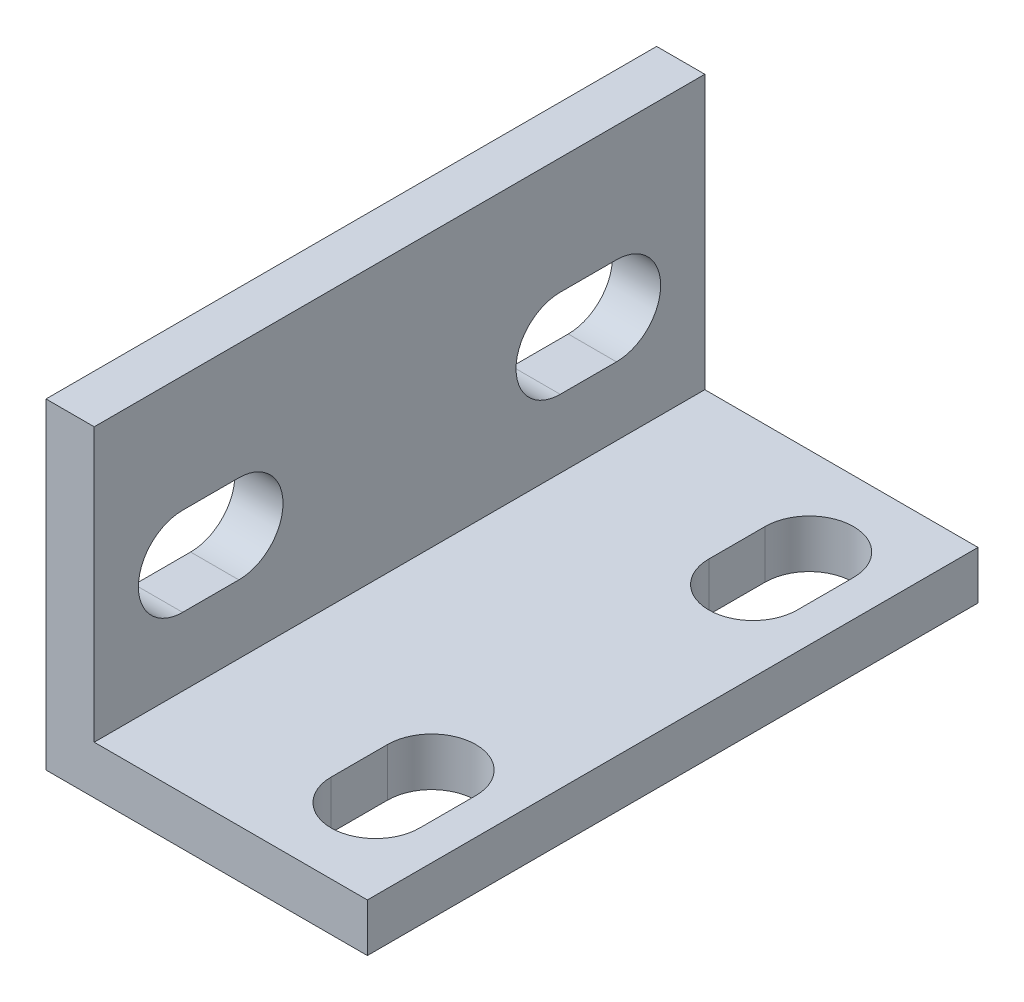
ISO-10303-21;
HEADER;
FILE_DESCRIPTION(('STEP AP214'),'2;1');
FILE_NAME('part.step','',(''),(''),'','','');
FILE_SCHEMA(('AUTOMOTIVE_DESIGN { 1 0 10303 214 1 1 1 1 }'));
ENDSEC;
DATA;
#1=APPLICATION_CONTEXT('core data for automotive mechanical design processes');
#2=APPLICATION_PROTOCOL_DEFINITION('international standard','automotive_design',2000,#1);
#3=PRODUCT_CONTEXT('',#1,'mechanical');
#4=PRODUCT('Part','Part','',(#3));
#5=PRODUCT_RELATED_PRODUCT_CATEGORY('part','',(#4));
#6=PRODUCT_DEFINITION_FORMATION('','',#4);
#7=PRODUCT_DEFINITION_CONTEXT('part definition',#1,'design');
#8=PRODUCT_DEFINITION('design','',#6,#7);
#9=PRODUCT_DEFINITION_SHAPE('','',#8);
#10=(LENGTH_UNIT() NAMED_UNIT(*) SI_UNIT(.MILLI.,.METRE.));
#11=(NAMED_UNIT(*) PLANE_ANGLE_UNIT() SI_UNIT($,.RADIAN.));
#12=(NAMED_UNIT(*) SI_UNIT($,.STERADIAN.) SOLID_ANGLE_UNIT());
#13=UNCERTAINTY_MEASURE_WITH_UNIT(LENGTH_MEASURE(1.E-05),#10,'distance_accuracy_value','');
#14=(GEOMETRIC_REPRESENTATION_CONTEXT(3) GLOBAL_UNCERTAINTY_ASSIGNED_CONTEXT((#13)) GLOBAL_UNIT_ASSIGNED_CONTEXT((#10,
#11,#12)) REPRESENTATION_CONTEXT('',''));
#15=CARTESIAN_POINT('',(0.,0.,0.));
#16=DIRECTION('',(0.,0.,1.));
#17=DIRECTION('',(1.,0.,0.));
#18=AXIS2_PLACEMENT_3D('',#15,#16,#17);
#19=CARTESIAN_POINT('',(0.,0.,38.));
#20=DIRECTION('',(0.,1.,0.));
#21=DIRECTION('',(0.,0.,1.));
#22=AXIS2_PLACEMENT_3D('',#19,#20,#21);
#23=PLANE('',#22);
#24=DIRECTION('',(0.,0.,-1.));
#25=VECTOR('',#24,1.);
#26=CARTESIAN_POINT('',(17.75,0.,5.49999999999999));
#27=LINE('',#26,#25);
#28=CARTESIAN_POINT('',(17.75,0.,9.));
#29=VERTEX_POINT('',#28);
#30=CARTESIAN_POINT('',(17.75,0.,5.49999999999999));
#31=VERTEX_POINT('',#30);
#32=EDGE_CURVE('E196',#29,#31,#27,.T.);
#33=ORIENTED_EDGE('',*,*,#32,.T.);
#34=CARTESIAN_POINT('',(15.,0.,5.49999999999999));
#35=DIRECTION('',(0.,1.,0.));
#36=DIRECTION('',(0.,0.,-1.));
#37=AXIS2_PLACEMENT_3D('',#34,#35,#36);
#38=CIRCLE('',#37,2.75000000000001);
#39=CARTESIAN_POINT('',(12.25,0.,5.49999999999999));
#40=VERTEX_POINT('',#39);
#41=EDGE_CURVE('E190',#31,#40,#38,.T.);
#42=ORIENTED_EDGE('',*,*,#41,.T.);
#43=DIRECTION('',(0.,0.,1.));
#44=VECTOR('',#43,1.);
#45=CARTESIAN_POINT('',(12.25,0.,5.49999999999999));
#46=LINE('',#45,#44);
#47=CARTESIAN_POINT('',(12.25,0.,9.));
#48=VERTEX_POINT('',#47);
#49=EDGE_CURVE('E199',#40,#48,#46,.T.);
#50=ORIENTED_EDGE('',*,*,#49,.T.);
#51=CARTESIAN_POINT('',(15.,0.,9.));
#52=DIRECTION('',(0.,1.,0.));
#53=DIRECTION('',(0.,0.,-1.));
#54=AXIS2_PLACEMENT_3D('',#51,#52,#53);
#55=CIRCLE('',#54,2.75000000000001);
#56=EDGE_CURVE('E55',#48,#29,#55,.T.);
#57=ORIENTED_EDGE('',*,*,#56,.T.);
#58=EDGE_LOOP('',(#33,#42,#50,#57));
#59=FACE_BOUND('',#58,.T.);
#60=DIRECTION('',(0.,0.,1.));
#61=VECTOR('',#60,1.);
#62=CARTESIAN_POINT('',(12.25,0.,32.5));
#63=LINE('',#62,#61);
#64=CARTESIAN_POINT('',(12.25,0.,29.));
#65=VERTEX_POINT('',#64);
#66=CARTESIAN_POINT('',(12.25,0.,32.5));
#67=VERTEX_POINT('',#66);
#68=EDGE_CURVE('E234',#65,#67,#63,.T.);
#69=ORIENTED_EDGE('',*,*,#68,.T.);
#70=CARTESIAN_POINT('',(15.,0.,32.5));
#71=DIRECTION('',(0.,1.,0.));
#72=DIRECTION('',(0.,0.,1.));
#73=AXIS2_PLACEMENT_3D('',#70,#71,#72);
#74=CIRCLE('',#73,2.75);
#75=CARTESIAN_POINT('',(17.75,0.,32.5));
#76=VERTEX_POINT('',#75);
#77=EDGE_CURVE('E224',#67,#76,#74,.T.);
#78=ORIENTED_EDGE('',*,*,#77,.T.);
#79=DIRECTION('',(0.,0.,-1.));
#80=VECTOR('',#79,1.);
#81=CARTESIAN_POINT('',(17.75,0.,32.5));
#82=LINE('',#81,#80);
#83=CARTESIAN_POINT('',(17.75,0.,29.));
#84=VERTEX_POINT('',#83);
#85=EDGE_CURVE('E227',#76,#84,#82,.T.);
#86=ORIENTED_EDGE('',*,*,#85,.T.);
#87=CARTESIAN_POINT('',(15.,0.,29.));
#88=DIRECTION('',(0.,1.,0.));
#89=DIRECTION('',(0.,0.,1.));
#90=AXIS2_PLACEMENT_3D('',#87,#88,#89);
#91=CIRCLE('',#90,2.75000000000001);
#92=EDGE_CURVE('E231',#84,#65,#91,.T.);
#93=ORIENTED_EDGE('',*,*,#92,.T.);
#94=EDGE_LOOP('',(#69,#78,#86,#93));
#95=FACE_BOUND('',#94,.T.);
#96=DIRECTION('',(1.,0.,0.));
#97=VECTOR('',#96,1.);
#98=CARTESIAN_POINT('',(0.,0.,0.));
#99=LINE('',#98,#97);
#100=CARTESIAN_POINT('',(0.,0.,0.));
#101=VERTEX_POINT('',#100);
#102=CARTESIAN_POINT('',(20.,0.,0.));
#103=VERTEX_POINT('',#102);
#104=EDGE_CURVE('E313',#101,#103,#99,.T.);
#105=ORIENTED_EDGE('',*,*,#104,.T.);
#106=DIRECTION('',(0.,0.,-1.));
#107=VECTOR('',#106,1.);
#108=CARTESIAN_POINT('',(20.,0.,38.));
#109=LINE('',#108,#107);
#110=CARTESIAN_POINT('',(20.,0.,38.));
#111=VERTEX_POINT('',#110);
#112=EDGE_CURVE('E11',#111,#103,#109,.T.);
#113=ORIENTED_EDGE('',*,*,#112,.F.);
#114=DIRECTION('',(1.,0.,0.));
#115=VECTOR('',#114,1.);
#116=CARTESIAN_POINT('',(0.,0.,38.));
#117=LINE('',#116,#115);
#118=CARTESIAN_POINT('',(0.,0.,38.));
#119=VERTEX_POINT('',#118);
#120=EDGE_CURVE('E320',#119,#111,#117,.T.);
#121=ORIENTED_EDGE('',*,*,#120,.F.);
#122=DIRECTION('',(0.,0.,-1.));
#123=VECTOR('',#122,1.);
#124=CARTESIAN_POINT('',(0.,0.,38.));
#125=LINE('',#124,#123);
#126=EDGE_CURVE('E337',#119,#101,#125,.T.);
#127=ORIENTED_EDGE('',*,*,#126,.T.);
#128=EDGE_LOOP('',(#105,#113,#121,#127));
#129=FACE_BOUND('',#128,.T.);
#130=ADVANCED_FACE('F41',(#59,#95,#129),#23,.F.);
#131=CARTESIAN_POINT('',(20.,3.,38.));
#132=DIRECTION('',(1.,0.,0.));
#133=DIRECTION('',(0.,0.,-1.));
#134=AXIS2_PLACEMENT_3D('',#131,#132,#133);
#135=PLANE('',#134);
#136=DIRECTION('',(0.,-1.,0.));
#137=VECTOR('',#136,1.);
#138=CARTESIAN_POINT('',(20.,3.,0.));
#139=LINE('',#138,#137);
#140=CARTESIAN_POINT('',(20.,3.,0.));
#141=VERTEX_POINT('',#140);
#142=EDGE_CURVE('E340',#141,#103,#139,.T.);
#143=ORIENTED_EDGE('',*,*,#142,.F.);
#144=DIRECTION('',(0.,0.,-1.));
#145=VECTOR('',#144,1.);
#146=CARTESIAN_POINT('',(20.,3.,38.));
#147=LINE('',#146,#145);
#148=CARTESIAN_POINT('',(20.,3.,38.));
#149=VERTEX_POINT('',#148);
#150=EDGE_CURVE('E48',#149,#141,#147,.T.);
#151=ORIENTED_EDGE('',*,*,#150,.F.);
#152=DIRECTION('',(0.,-1.,0.));
#153=VECTOR('',#152,1.);
#154=CARTESIAN_POINT('',(20.,3.,38.));
#155=LINE('',#154,#153);
#156=EDGE_CURVE('E322',#149,#111,#155,.T.);
#157=ORIENTED_EDGE('',*,*,#156,.T.);
#158=ORIENTED_EDGE('',*,*,#112,.T.);
#159=EDGE_LOOP('',(#143,#151,#157,#158));
#160=FACE_BOUND('',#159,.T.);
#161=ADVANCED_FACE('F367',(#160),#135,.T.);
#162=CARTESIAN_POINT('',(0.,3.,38.));
#163=DIRECTION('',(0.,1.,0.));
#164=DIRECTION('',(0.,0.,1.));
#165=AXIS2_PLACEMENT_3D('',#162,#163,#164);
#166=PLANE('',#165);
#167=CARTESIAN_POINT('',(15.,3.,5.49999999999999));
#168=DIRECTION('',(0.,1.,0.));
#169=DIRECTION('',(0.,0.,-1.));
#170=AXIS2_PLACEMENT_3D('',#167,#168,#169);
#171=CIRCLE('',#170,2.75000000000001);
#172=CARTESIAN_POINT('',(17.75,3.,5.49999999999999));
#173=VERTEX_POINT('',#172);
#174=CARTESIAN_POINT('',(12.25,3.,5.5));
#175=VERTEX_POINT('',#174);
#176=EDGE_CURVE('E63',#173,#175,#171,.T.);
#177=ORIENTED_EDGE('',*,*,#176,.F.);
#178=DIRECTION('',(0.,0.,-1.));
#179=VECTOR('',#178,1.);
#180=CARTESIAN_POINT('',(17.75,3.,5.49999999999999));
#181=LINE('',#180,#179);
#182=CARTESIAN_POINT('',(17.75,3.,9.));
#183=VERTEX_POINT('',#182);
#184=EDGE_CURVE('E205',#183,#173,#181,.T.);
#185=ORIENTED_EDGE('',*,*,#184,.F.);
#186=CARTESIAN_POINT('',(15.,3.,9.));
#187=DIRECTION('',(0.,1.,0.));
#188=DIRECTION('',(0.,0.,-1.));
#189=AXIS2_PLACEMENT_3D('',#186,#187,#188);
#190=CIRCLE('',#189,2.75000000000001);
#191=CARTESIAN_POINT('',(12.25,3.,9.));
#192=VERTEX_POINT('',#191);
#193=EDGE_CURVE('E208',#192,#183,#190,.T.);
#194=ORIENTED_EDGE('',*,*,#193,.F.);
#195=DIRECTION('',(0.,0.,1.));
#196=VECTOR('',#195,1.);
#197=CARTESIAN_POINT('',(12.25,3.,5.49999999999999));
#198=LINE('',#197,#196);
#199=EDGE_CURVE('E214',#175,#192,#198,.T.);
#200=ORIENTED_EDGE('',*,*,#199,.F.);
#201=EDGE_LOOP('',(#177,#185,#194,#200));
#202=FACE_BOUND('',#201,.T.);
#203=CARTESIAN_POINT('',(15.,3.,32.5));
#204=DIRECTION('',(0.,1.,0.));
#205=DIRECTION('',(0.,0.,1.));
#206=AXIS2_PLACEMENT_3D('',#203,#204,#205);
#207=CIRCLE('',#206,2.75);
#208=CARTESIAN_POINT('',(12.25,3.,32.5));
#209=VERTEX_POINT('',#208);
#210=CARTESIAN_POINT('',(17.75,3.,32.5));
#211=VERTEX_POINT('',#210);
#212=EDGE_CURVE('E220',#209,#211,#207,.T.);
#213=ORIENTED_EDGE('',*,*,#212,.F.);
#214=DIRECTION('',(0.,0.,1.));
#215=VECTOR('',#214,1.);
#216=CARTESIAN_POINT('',(12.25,3.,32.5));
#217=LINE('',#216,#215);
#218=CARTESIAN_POINT('',(12.25,3.,29.));
#219=VERTEX_POINT('',#218);
#220=EDGE_CURVE('E228',#219,#209,#217,.T.);
#221=ORIENTED_EDGE('',*,*,#220,.F.);
#222=CARTESIAN_POINT('',(15.,3.,29.));
#223=DIRECTION('',(0.,1.,0.));
#224=DIRECTION('',(0.,0.,1.));
#225=AXIS2_PLACEMENT_3D('',#222,#223,#224);
#226=CIRCLE('',#225,2.75000000000001);
#227=CARTESIAN_POINT('',(17.75,3.,29.));
#228=VERTEX_POINT('',#227);
#229=EDGE_CURVE('E242',#228,#219,#226,.T.);
#230=ORIENTED_EDGE('',*,*,#229,.F.);
#231=DIRECTION('',(0.,0.,-1.));
#232=VECTOR('',#231,1.);
#233=CARTESIAN_POINT('',(17.75,3.,32.5));
#234=LINE('',#233,#232);
#235=EDGE_CURVE('E239',#211,#228,#234,.T.);
#236=ORIENTED_EDGE('',*,*,#235,.F.);
#237=EDGE_LOOP('',(#213,#221,#230,#236));
#238=FACE_BOUND('',#237,.T.);
#239=DIRECTION('',(1.,0.,0.));
#240=VECTOR('',#239,1.);
#241=CARTESIAN_POINT('',(0.,3.,0.));
#242=LINE('',#241,#240);
#243=CARTESIAN_POINT('',(3.,3.,0.));
#244=VERTEX_POINT('',#243);
#245=EDGE_CURVE('E343',#244,#141,#242,.T.);
#246=ORIENTED_EDGE('',*,*,#245,.F.);
#247=DIRECTION('',(0.,0.,-1.));
#248=VECTOR('',#247,1.);
#249=CARTESIAN_POINT('',(3.,3.,38.));
#250=LINE('',#249,#248);
#251=CARTESIAN_POINT('',(3.,3.,38.));
#252=VERTEX_POINT('',#251);
#253=EDGE_CURVE('E359',#252,#244,#250,.T.);
#254=ORIENTED_EDGE('',*,*,#253,.F.);
#255=DIRECTION('',(1.,0.,0.));
#256=VECTOR('',#255,1.);
#257=CARTESIAN_POINT('',(0.,3.,38.));
#258=LINE('',#257,#256);
#259=EDGE_CURVE('E326',#252,#149,#258,.T.);
#260=ORIENTED_EDGE('',*,*,#259,.T.);
#261=ORIENTED_EDGE('',*,*,#150,.T.);
#262=EDGE_LOOP('',(#246,#254,#260,#261));
#263=FACE_BOUND('',#262,.T.);
#264=ADVANCED_FACE('F363',(#202,#238,#263),#166,.T.);
#265=CARTESIAN_POINT('',(3.,20.,38.));
#266=DIRECTION('',(1.,0.,0.));
#267=DIRECTION('',(0.,0.,-1.));
#268=AXIS2_PLACEMENT_3D('',#265,#266,#267);
#269=PLANE('',#268);
#270=CARTESIAN_POINT('',(3.,10.,9.00000000000001));
#271=DIRECTION('',(1.,0.,0.));
#272=DIRECTION('',(0.,0.,1.));
#273=AXIS2_PLACEMENT_3D('',#270,#271,#272);
#274=CIRCLE('',#273,2.75);
#275=CARTESIAN_POINT('',(3.,12.75,9.00000000000001));
#276=VERTEX_POINT('',#275);
#277=CARTESIAN_POINT('',(3.,7.25,9.));
#278=VERTEX_POINT('',#277);
#279=EDGE_CURVE('E249',#276,#278,#274,.T.);
#280=ORIENTED_EDGE('',*,*,#279,.F.);
#281=DIRECTION('',(0.,0.,1.));
#282=VECTOR('',#281,1.);
#283=CARTESIAN_POINT('',(3.,12.75,9.00000000000001));
#284=LINE('',#283,#282);
#285=CARTESIAN_POINT('',(3.,12.75,5.5));
#286=VERTEX_POINT('',#285);
#287=EDGE_CURVE('E260',#286,#276,#284,.T.);
#288=ORIENTED_EDGE('',*,*,#287,.F.);
#289=CARTESIAN_POINT('',(3.,10.,5.5));
#290=DIRECTION('',(1.,0.,0.));
#291=DIRECTION('',(0.,0.,1.));
#292=AXIS2_PLACEMENT_3D('',#289,#290,#291);
#293=CIRCLE('',#292,2.75);
#294=CARTESIAN_POINT('',(3.,7.25,5.5));
#295=VERTEX_POINT('',#294);
#296=EDGE_CURVE('E274',#295,#286,#293,.T.);
#297=ORIENTED_EDGE('',*,*,#296,.F.);
#298=DIRECTION('',(0.,0.,-1.));
#299=VECTOR('',#298,1.);
#300=CARTESIAN_POINT('',(3.,7.25,9.00000000000001));
#301=LINE('',#300,#299);
#302=EDGE_CURVE('E271',#278,#295,#301,.T.);
#303=ORIENTED_EDGE('',*,*,#302,.F.);
#304=EDGE_LOOP('',(#280,#288,#297,#303));
#305=FACE_BOUND('',#304,.T.);
#306=CARTESIAN_POINT('',(3.,10.,29.));
#307=DIRECTION('',(1.,0.,0.));
#308=DIRECTION('',(0.,0.,-1.));
#309=AXIS2_PLACEMENT_3D('',#306,#307,#308);
#310=CIRCLE('',#309,2.75);
#311=CARTESIAN_POINT('',(3.,7.25,29.));
#312=VERTEX_POINT('',#311);
#313=CARTESIAN_POINT('',(3.,12.75,29.));
#314=VERTEX_POINT('',#313);
#315=EDGE_CURVE('E281',#312,#314,#310,.T.);
#316=ORIENTED_EDGE('',*,*,#315,.F.);
#317=DIRECTION('',(0.,0.,-1.));
#318=VECTOR('',#317,1.);
#319=CARTESIAN_POINT('',(3.,7.25,29.));
#320=LINE('',#319,#318);
#321=CARTESIAN_POINT('',(3.,7.25,32.5));
#322=VERTEX_POINT('',#321);
#323=EDGE_CURVE('E292',#322,#312,#320,.T.);
#324=ORIENTED_EDGE('',*,*,#323,.F.);
#325=CARTESIAN_POINT('',(3.,10.,32.5));
#326=DIRECTION('',(1.,0.,0.));
#327=DIRECTION('',(0.,0.,-1.));
#328=AXIS2_PLACEMENT_3D('',#325,#326,#327);
#329=CIRCLE('',#328,2.75);
#330=CARTESIAN_POINT('',(3.,12.75,32.5));
#331=VERTEX_POINT('',#330);
#332=EDGE_CURVE('E306',#331,#322,#329,.T.);
#333=ORIENTED_EDGE('',*,*,#332,.F.);
#334=DIRECTION('',(0.,0.,1.));
#335=VECTOR('',#334,1.);
#336=CARTESIAN_POINT('',(3.,12.75,29.));
#337=LINE('',#336,#335);
#338=EDGE_CURVE('E303',#314,#331,#337,.T.);
#339=ORIENTED_EDGE('',*,*,#338,.F.);
#340=EDGE_LOOP('',(#316,#324,#333,#339));
#341=FACE_BOUND('',#340,.T.);
#342=DIRECTION('',(0.,1.,0.));
#343=VECTOR('',#342,1.);
#344=CARTESIAN_POINT('',(3.,20.,0.));
#345=LINE('',#344,#343);
#346=CARTESIAN_POINT('',(3.,20.,0.));
#347=VERTEX_POINT('',#346);
#348=EDGE_CURVE('E346',#347,#244,#345,.F.);
#349=ORIENTED_EDGE('',*,*,#348,.F.);
#350=DIRECTION('',(0.,0.,-1.));
#351=VECTOR('',#350,1.);
#352=CARTESIAN_POINT('',(3.,20.,38.));
#353=LINE('',#352,#351);
#354=CARTESIAN_POINT('',(3.,20.,38.));
#355=VERTEX_POINT('',#354);
#356=EDGE_CURVE('E357',#355,#347,#353,.T.);
#357=ORIENTED_EDGE('',*,*,#356,.F.);
#358=DIRECTION('',(0.,1.,0.));
#359=VECTOR('',#358,1.);
#360=CARTESIAN_POINT('',(3.,20.,38.));
#361=LINE('',#360,#359);
#362=EDGE_CURVE('E329',#355,#252,#361,.F.);
#363=ORIENTED_EDGE('',*,*,#362,.T.);
#364=ORIENTED_EDGE('',*,*,#253,.T.);
#365=EDGE_LOOP('',(#349,#357,#363,#364));
#366=FACE_BOUND('',#365,.T.);
#367=ADVANCED_FACE('F376',(#305,#341,#366),#269,.T.);
#368=CARTESIAN_POINT('',(0.,20.,38.));
#369=DIRECTION('',(0.,1.,0.));
#370=DIRECTION('',(0.,0.,1.));
#371=AXIS2_PLACEMENT_3D('',#368,#369,#370);
#372=PLANE('',#371);
#373=DIRECTION('',(1.,0.,0.));
#374=VECTOR('',#373,1.);
#375=CARTESIAN_POINT('',(0.,20.,0.));
#376=LINE('',#375,#374);
#377=CARTESIAN_POINT('',(0.,20.,0.));
#378=VERTEX_POINT('',#377);
#379=EDGE_CURVE('E349',#378,#347,#376,.T.);
#380=ORIENTED_EDGE('',*,*,#379,.F.);
#381=DIRECTION('',(0.,0.,-1.));
#382=VECTOR('',#381,1.);
#383=CARTESIAN_POINT('',(0.,20.,38.));
#384=LINE('',#383,#382);
#385=CARTESIAN_POINT('',(0.,20.,38.));
#386=VERTEX_POINT('',#385);
#387=EDGE_CURVE('E355',#386,#378,#384,.T.);
#388=ORIENTED_EDGE('',*,*,#387,.F.);
#389=DIRECTION('',(1.,0.,0.));
#390=VECTOR('',#389,1.);
#391=CARTESIAN_POINT('',(0.,20.,38.));
#392=LINE('',#391,#390);
#393=EDGE_CURVE('E332',#386,#355,#392,.T.);
#394=ORIENTED_EDGE('',*,*,#393,.T.);
#395=ORIENTED_EDGE('',*,*,#356,.T.);
#396=EDGE_LOOP('',(#380,#388,#394,#395));
#397=FACE_BOUND('',#396,.T.);
#398=ADVANCED_FACE('F387',(#397),#372,.T.);
#399=CARTESIAN_POINT('',(0.,20.,38.));
#400=DIRECTION('',(1.,0.,0.));
#401=DIRECTION('',(0.,0.,-1.));
#402=AXIS2_PLACEMENT_3D('',#399,#400,#401);
#403=PLANE('',#402);
#404=DIRECTION('',(0.,0.,1.));
#405=VECTOR('',#404,1.);
#406=CARTESIAN_POINT('',(0.,12.75,9.00000000000001));
#407=LINE('',#406,#405);
#408=CARTESIAN_POINT('',(0.,12.75,5.5));
#409=VERTEX_POINT('',#408);
#410=CARTESIAN_POINT('',(0.,12.75,9.00000000000001));
#411=VERTEX_POINT('',#410);
#412=EDGE_CURVE('E266',#409,#411,#407,.T.);
#413=ORIENTED_EDGE('',*,*,#412,.T.);
#414=CARTESIAN_POINT('',(0.,10.,9.00000000000001));
#415=DIRECTION('',(1.,0.,0.));
#416=DIRECTION('',(0.,0.,1.));
#417=AXIS2_PLACEMENT_3D('',#414,#415,#416);
#418=CIRCLE('',#417,2.75);
#419=CARTESIAN_POINT('',(0.,7.25,9.00000000000001));
#420=VERTEX_POINT('',#419);
#421=EDGE_CURVE('E256',#411,#420,#418,.T.);
#422=ORIENTED_EDGE('',*,*,#421,.T.);
#423=DIRECTION('',(0.,0.,-1.));
#424=VECTOR('',#423,1.);
#425=CARTESIAN_POINT('',(0.,7.25,9.00000000000001));
#426=LINE('',#425,#424);
#427=CARTESIAN_POINT('',(0.,7.25,5.50000000000001));
#428=VERTEX_POINT('',#427);
#429=EDGE_CURVE('E259',#420,#428,#426,.T.);
#430=ORIENTED_EDGE('',*,*,#429,.T.);
#431=CARTESIAN_POINT('',(0.,10.,5.5));
#432=DIRECTION('',(1.,0.,0.));
#433=DIRECTION('',(0.,0.,1.));
#434=AXIS2_PLACEMENT_3D('',#431,#432,#433);
#435=CIRCLE('',#434,2.75);
#436=EDGE_CURVE('E263',#428,#409,#435,.T.);
#437=ORIENTED_EDGE('',*,*,#436,.T.);
#438=EDGE_LOOP('',(#413,#422,#430,#437));
#439=FACE_BOUND('',#438,.T.);
#440=DIRECTION('',(0.,0.,-1.));
#441=VECTOR('',#440,1.);
#442=CARTESIAN_POINT('',(0.,7.25,29.));
#443=LINE('',#442,#441);
#444=CARTESIAN_POINT('',(0.,7.25,32.5));
#445=VERTEX_POINT('',#444);
#446=CARTESIAN_POINT('',(0.,7.25,29.));
#447=VERTEX_POINT('',#446);
#448=EDGE_CURVE('E298',#445,#447,#443,.T.);
#449=ORIENTED_EDGE('',*,*,#448,.T.);
#450=CARTESIAN_POINT('',(0.,10.,29.));
#451=DIRECTION('',(1.,0.,0.));
#452=DIRECTION('',(0.,0.,-1.));
#453=AXIS2_PLACEMENT_3D('',#450,#451,#452);
#454=CIRCLE('',#453,2.75);
#455=CARTESIAN_POINT('',(0.,12.75,29.));
#456=VERTEX_POINT('',#455);
#457=EDGE_CURVE('E288',#447,#456,#454,.T.);
#458=ORIENTED_EDGE('',*,*,#457,.T.);
#459=DIRECTION('',(0.,0.,1.));
#460=VECTOR('',#459,1.);
#461=CARTESIAN_POINT('',(0.,12.75,29.));
#462=LINE('',#461,#460);
#463=CARTESIAN_POINT('',(0.,12.75,32.5));
#464=VERTEX_POINT('',#463);
#465=EDGE_CURVE('E291',#456,#464,#462,.T.);
#466=ORIENTED_EDGE('',*,*,#465,.T.);
#467=CARTESIAN_POINT('',(0.,10.,32.5));
#468=DIRECTION('',(1.,0.,0.));
#469=DIRECTION('',(0.,0.,-1.));
#470=AXIS2_PLACEMENT_3D('',#467,#468,#469);
#471=CIRCLE('',#470,2.75);
#472=EDGE_CURVE('E295',#464,#445,#471,.T.);
#473=ORIENTED_EDGE('',*,*,#472,.T.);
#474=EDGE_LOOP('',(#449,#458,#466,#473));
#475=FACE_BOUND('',#474,.T.);
#476=DIRECTION('',(0.,-1.,0.));
#477=VECTOR('',#476,1.);
#478=CARTESIAN_POINT('',(0.,20.,0.));
#479=LINE('',#478,#477);
#480=EDGE_CURVE('E323',#378,#101,#479,.T.);
#481=ORIENTED_EDGE('',*,*,#480,.T.);
#482=ORIENTED_EDGE('',*,*,#126,.F.);
#483=DIRECTION('',(0.,-1.,0.));
#484=VECTOR('',#483,1.);
#485=CARTESIAN_POINT('',(0.,20.,38.));
#486=LINE('',#485,#484);
#487=EDGE_CURVE('E335',#386,#119,#486,.T.);
#488=ORIENTED_EDGE('',*,*,#487,.F.);
#489=ORIENTED_EDGE('',*,*,#387,.T.);
#490=EDGE_LOOP('',(#481,#482,#488,#489));
#491=FACE_BOUND('',#490,.T.);
#492=ADVANCED_FACE('F388',(#439,#475,#491),#403,.F.);
#493=CARTESIAN_POINT('',(0.,0.,38.));
#494=DIRECTION('',(0.,0.,-1.));
#495=DIRECTION('',(-1.,0.,0.));
#496=AXIS2_PLACEMENT_3D('',#493,#494,#495);
#497=PLANE('',#496);
#498=ORIENTED_EDGE('',*,*,#120,.T.);
#499=ORIENTED_EDGE('',*,*,#156,.F.);
#500=ORIENTED_EDGE('',*,*,#259,.F.);
#501=ORIENTED_EDGE('',*,*,#362,.F.);
#502=ORIENTED_EDGE('',*,*,#393,.F.);
#503=ORIENTED_EDGE('',*,*,#487,.T.);
#504=EDGE_LOOP('',(#498,#499,#500,#501,#502,#503));
#505=FACE_BOUND('',#504,.T.);
#506=ADVANCED_FACE('F379',(#505),#497,.F.);
#507=CARTESIAN_POINT('',(0.,0.,0.));
#508=DIRECTION('',(0.,0.,-1.));
#509=DIRECTION('',(-1.,0.,0.));
#510=AXIS2_PLACEMENT_3D('',#507,#508,#509);
#511=PLANE('',#510);
#512=ORIENTED_EDGE('',*,*,#104,.F.);
#513=ORIENTED_EDGE('',*,*,#480,.F.);
#514=ORIENTED_EDGE('',*,*,#379,.T.);
#515=ORIENTED_EDGE('',*,*,#348,.T.);
#516=ORIENTED_EDGE('',*,*,#245,.T.);
#517=ORIENTED_EDGE('',*,*,#142,.T.);
#518=EDGE_LOOP('',(#512,#513,#514,#515,#516,#517));
#519=FACE_BOUND('',#518,.T.);
#520=ADVANCED_FACE('F371',(#519),#511,.T.);
#521=CARTESIAN_POINT('',(0.,10.,29.));
#522=DIRECTION('',(1.,0.,0.));
#523=DIRECTION('',(0.,0.,-1.));
#524=AXIS2_PLACEMENT_3D('',#521,#522,#523);
#525=CYLINDRICAL_SURFACE('',#524,2.75);
#526=ORIENTED_EDGE('',*,*,#315,.T.);
#527=DIRECTION('',(1.,0.,0.));
#528=VECTOR('',#527,1.);
#529=CARTESIAN_POINT('',(0.,12.75,29.));
#530=LINE('',#529,#528);
#531=EDGE_CURVE('E301',#456,#314,#530,.T.);
#532=ORIENTED_EDGE('',*,*,#531,.F.);
#533=ORIENTED_EDGE('',*,*,#457,.F.);
#534=DIRECTION('',(1.,0.,0.));
#535=VECTOR('',#534,1.);
#536=CARTESIAN_POINT('',(0.,7.25,29.));
#537=LINE('',#536,#535);
#538=EDGE_CURVE('E311',#447,#312,#537,.T.);
#539=ORIENTED_EDGE('',*,*,#538,.T.);
#540=EDGE_LOOP('',(#526,#532,#533,#539));
#541=FACE_BOUND('',#540,.T.);
#542=ADVANCED_FACE('F426',(#541),#525,.F.);
#543=CARTESIAN_POINT('',(0.,7.25,29.));
#544=DIRECTION('',(0.,-1.,0.));
#545=DIRECTION('',(0.,0.,-1.));
#546=AXIS2_PLACEMENT_3D('',#543,#544,#545);
#547=PLANE('',#546);
#548=ORIENTED_EDGE('',*,*,#323,.T.);
#549=ORIENTED_EDGE('',*,*,#538,.F.);
#550=ORIENTED_EDGE('',*,*,#448,.F.);
#551=DIRECTION('',(1.,0.,0.));
#552=VECTOR('',#551,1.);
#553=CARTESIAN_POINT('',(0.,7.25,32.5));
#554=LINE('',#553,#552);
#555=EDGE_CURVE('E314',#445,#322,#554,.T.);
#556=ORIENTED_EDGE('',*,*,#555,.T.);
#557=EDGE_LOOP('',(#548,#549,#550,#556));
#558=FACE_BOUND('',#557,.T.);
#559=ADVANCED_FACE('F434',(#558),#547,.F.);
#560=CARTESIAN_POINT('',(0.,10.,32.5));
#561=DIRECTION('',(1.,0.,0.));
#562=DIRECTION('',(0.,0.,-1.));
#563=AXIS2_PLACEMENT_3D('',#560,#561,#562);
#564=CYLINDRICAL_SURFACE('',#563,2.75);
#565=ORIENTED_EDGE('',*,*,#332,.T.);
#566=ORIENTED_EDGE('',*,*,#555,.F.);
#567=ORIENTED_EDGE('',*,*,#472,.F.);
#568=DIRECTION('',(1.,0.,0.));
#569=VECTOR('',#568,1.);
#570=CARTESIAN_POINT('',(0.,12.75,32.5));
#571=LINE('',#570,#569);
#572=EDGE_CURVE('E316',#464,#331,#571,.T.);
#573=ORIENTED_EDGE('',*,*,#572,.T.);
#574=EDGE_LOOP('',(#565,#566,#567,#573));
#575=FACE_BOUND('',#574,.T.);
#576=ADVANCED_FACE('F436',(#575),#564,.F.);
#577=CARTESIAN_POINT('',(0.,12.75,29.));
#578=DIRECTION('',(0.,1.,0.));
#579=DIRECTION('',(0.,0.,1.));
#580=AXIS2_PLACEMENT_3D('',#577,#578,#579);
#581=PLANE('',#580);
#582=ORIENTED_EDGE('',*,*,#338,.T.);
#583=ORIENTED_EDGE('',*,*,#572,.F.);
#584=ORIENTED_EDGE('',*,*,#465,.F.);
#585=ORIENTED_EDGE('',*,*,#531,.T.);
#586=EDGE_LOOP('',(#582,#583,#584,#585));
#587=FACE_BOUND('',#586,.T.);
#588=ADVANCED_FACE('F430',(#587),#581,.F.);
#589=CARTESIAN_POINT('',(0.,10.,9.00000000000001));
#590=DIRECTION('',(1.,0.,0.));
#591=DIRECTION('',(0.,0.,-1.));
#592=AXIS2_PLACEMENT_3D('',#589,#590,#591);
#593=CYLINDRICAL_SURFACE('',#592,2.75);
#594=ORIENTED_EDGE('',*,*,#279,.T.);
#595=DIRECTION('',(1.,0.,0.));
#596=VECTOR('',#595,1.);
#597=CARTESIAN_POINT('',(0.,7.25,9.00000000000001));
#598=LINE('',#597,#596);
#599=EDGE_CURVE('E269',#420,#278,#598,.T.);
#600=ORIENTED_EDGE('',*,*,#599,.F.);
#601=ORIENTED_EDGE('',*,*,#421,.F.);
#602=DIRECTION('',(1.,0.,0.));
#603=VECTOR('',#602,1.);
#604=CARTESIAN_POINT('',(0.,12.75,9.00000000000001));
#605=LINE('',#604,#603);
#606=EDGE_CURVE('E279',#411,#276,#605,.T.);
#607=ORIENTED_EDGE('',*,*,#606,.T.);
#608=EDGE_LOOP('',(#594,#600,#601,#607));
#609=FACE_BOUND('',#608,.T.);
#610=ADVANCED_FACE('F443',(#609),#593,.F.);
#611=CARTESIAN_POINT('',(0.,12.75,9.00000000000001));
#612=DIRECTION('',(0.,1.,0.));
#613=DIRECTION('',(0.,0.,1.));
#614=AXIS2_PLACEMENT_3D('',#611,#612,#613);
#615=PLANE('',#614);
#616=ORIENTED_EDGE('',*,*,#287,.T.);
#617=ORIENTED_EDGE('',*,*,#606,.F.);
#618=ORIENTED_EDGE('',*,*,#412,.F.);
#619=DIRECTION('',(1.,0.,0.));
#620=VECTOR('',#619,1.);
#621=CARTESIAN_POINT('',(0.,12.75,5.5));
#622=LINE('',#621,#620);
#623=EDGE_CURVE('E282',#409,#286,#622,.T.);
#624=ORIENTED_EDGE('',*,*,#623,.T.);
#625=EDGE_LOOP('',(#616,#617,#618,#624));
#626=FACE_BOUND('',#625,.T.);
#627=ADVANCED_FACE('F535',(#626),#615,.F.);
#628=CARTESIAN_POINT('',(0.,10.,5.5));
#629=DIRECTION('',(1.,0.,0.));
#630=DIRECTION('',(0.,0.,-1.));
#631=AXIS2_PLACEMENT_3D('',#628,#629,#630);
#632=CYLINDRICAL_SURFACE('',#631,2.75);
#633=ORIENTED_EDGE('',*,*,#296,.T.);
#634=ORIENTED_EDGE('',*,*,#623,.F.);
#635=ORIENTED_EDGE('',*,*,#436,.F.);
#636=DIRECTION('',(1.,0.,0.));
#637=VECTOR('',#636,1.);
#638=CARTESIAN_POINT('',(0.,7.25,5.5));
#639=LINE('',#638,#637);
#640=EDGE_CURVE('E284',#428,#295,#639,.T.);
#641=ORIENTED_EDGE('',*,*,#640,.T.);
#642=EDGE_LOOP('',(#633,#634,#635,#641));
#643=FACE_BOUND('',#642,.T.);
#644=ADVANCED_FACE('F538',(#643),#632,.F.);
#645=CARTESIAN_POINT('',(0.,7.25,9.00000000000001));
#646=DIRECTION('',(0.,-1.,0.));
#647=DIRECTION('',(0.,0.,-1.));
#648=AXIS2_PLACEMENT_3D('',#645,#646,#647);
#649=PLANE('',#648);
#650=ORIENTED_EDGE('',*,*,#302,.T.);
#651=ORIENTED_EDGE('',*,*,#640,.F.);
#652=ORIENTED_EDGE('',*,*,#429,.F.);
#653=ORIENTED_EDGE('',*,*,#599,.T.);
#654=EDGE_LOOP('',(#650,#651,#652,#653));
#655=FACE_BOUND('',#654,.T.);
#656=ADVANCED_FACE('F479',(#655),#649,.F.);
#657=CARTESIAN_POINT('',(15.,0.,32.5));
#658=DIRECTION('',(0.,1.,0.));
#659=DIRECTION('',(0.,0.,1.));
#660=AXIS2_PLACEMENT_3D('',#657,#658,#659);
#661=CYLINDRICAL_SURFACE('',#660,2.75);
#662=ORIENTED_EDGE('',*,*,#212,.T.);
#663=DIRECTION('',(0.,1.,0.));
#664=VECTOR('',#663,1.);
#665=CARTESIAN_POINT('',(17.75,0.,32.5));
#666=LINE('',#665,#664);
#667=EDGE_CURVE('E237',#76,#211,#666,.T.);
#668=ORIENTED_EDGE('',*,*,#667,.F.);
#669=ORIENTED_EDGE('',*,*,#77,.F.);
#670=DIRECTION('',(0.,1.,0.));
#671=VECTOR('',#670,1.);
#672=CARTESIAN_POINT('',(12.25,0.,32.5));
#673=LINE('',#672,#671);
#674=EDGE_CURVE('E247',#67,#209,#673,.T.);
#675=ORIENTED_EDGE('',*,*,#674,.T.);
#676=EDGE_LOOP('',(#662,#668,#669,#675));
#677=FACE_BOUND('',#676,.T.);
#678=ADVANCED_FACE('F474',(#677),#661,.F.);
#679=CARTESIAN_POINT('',(12.25,0.,32.5));
#680=DIRECTION('',(-1.,0.,0.));
#681=DIRECTION('',(0.,0.,1.));
#682=AXIS2_PLACEMENT_3D('',#679,#680,#681);
#683=PLANE('',#682);
#684=ORIENTED_EDGE('',*,*,#220,.T.);
#685=ORIENTED_EDGE('',*,*,#674,.F.);
#686=ORIENTED_EDGE('',*,*,#68,.F.);
#687=DIRECTION('',(0.,1.,0.));
#688=VECTOR('',#687,1.);
#689=CARTESIAN_POINT('',(12.25,0.,29.));
#690=LINE('',#689,#688);
#691=EDGE_CURVE('E250',#65,#219,#690,.T.);
#692=ORIENTED_EDGE('',*,*,#691,.T.);
#693=EDGE_LOOP('',(#684,#685,#686,#692));
#694=FACE_BOUND('',#693,.T.);
#695=ADVANCED_FACE('F478',(#694),#683,.F.);
#696=CARTESIAN_POINT('',(15.,0.,29.));
#697=DIRECTION('',(0.,1.,0.));
#698=DIRECTION('',(0.,0.,1.));
#699=AXIS2_PLACEMENT_3D('',#696,#697,#698);
#700=CYLINDRICAL_SURFACE('',#699,2.75000000000001);
#701=ORIENTED_EDGE('',*,*,#229,.T.);
#702=ORIENTED_EDGE('',*,*,#691,.F.);
#703=ORIENTED_EDGE('',*,*,#92,.F.);
#704=DIRECTION('',(0.,1.,0.));
#705=VECTOR('',#704,1.);
#706=CARTESIAN_POINT('',(17.75,0.,29.));
#707=LINE('',#706,#705);
#708=EDGE_CURVE('E252',#84,#228,#707,.T.);
#709=ORIENTED_EDGE('',*,*,#708,.T.);
#710=EDGE_LOOP('',(#701,#702,#703,#709));
#711=FACE_BOUND('',#710,.T.);
#712=ADVANCED_FACE('F488',(#711),#700,.F.);
#713=CARTESIAN_POINT('',(17.75,0.,32.5));
#714=DIRECTION('',(1.,0.,0.));
#715=DIRECTION('',(0.,0.,-1.));
#716=AXIS2_PLACEMENT_3D('',#713,#714,#715);
#717=PLANE('',#716);
#718=ORIENTED_EDGE('',*,*,#235,.T.);
#719=ORIENTED_EDGE('',*,*,#708,.F.);
#720=ORIENTED_EDGE('',*,*,#85,.F.);
#721=ORIENTED_EDGE('',*,*,#667,.T.);
#722=EDGE_LOOP('',(#718,#719,#720,#721));
#723=FACE_BOUND('',#722,.T.);
#724=ADVANCED_FACE('F496',(#723),#717,.F.);
#725=CARTESIAN_POINT('',(15.,0.,5.49999999999999));
#726=DIRECTION('',(0.,1.,0.));
#727=DIRECTION('',(0.,0.,1.));
#728=AXIS2_PLACEMENT_3D('',#725,#726,#727);
#729=CYLINDRICAL_SURFACE('',#728,2.75000000000001);
#730=ORIENTED_EDGE('',*,*,#176,.T.);
#731=DIRECTION('',(0.,1.,0.));
#732=VECTOR('',#731,1.);
#733=CARTESIAN_POINT('',(12.25,0.,5.49999999999999));
#734=LINE('',#733,#732);
#735=EDGE_CURVE('E186',#40,#175,#734,.T.);
#736=ORIENTED_EDGE('',*,*,#735,.F.);
#737=ORIENTED_EDGE('',*,*,#41,.F.);
#738=DIRECTION('',(0.,1.,0.));
#739=VECTOR('',#738,1.);
#740=CARTESIAN_POINT('',(17.75,0.,5.49999999999999));
#741=LINE('',#740,#739);
#742=EDGE_CURVE('E218',#31,#173,#741,.T.);
#743=ORIENTED_EDGE('',*,*,#742,.T.);
#744=EDGE_LOOP('',(#730,#736,#737,#743));
#745=FACE_BOUND('',#744,.T.);
#746=ADVANCED_FACE('F188',(#745),#729,.F.);
#747=CARTESIAN_POINT('',(17.75,0.,5.49999999999999));
#748=DIRECTION('',(1.,0.,0.));
#749=DIRECTION('',(0.,0.,-1.));
#750=AXIS2_PLACEMENT_3D('',#747,#748,#749);
#751=PLANE('',#750);
#752=ORIENTED_EDGE('',*,*,#184,.T.);
#753=ORIENTED_EDGE('',*,*,#742,.F.);
#754=ORIENTED_EDGE('',*,*,#32,.F.);
#755=DIRECTION('',(0.,1.,0.));
#756=VECTOR('',#755,1.);
#757=CARTESIAN_POINT('',(17.75,0.,9.));
#758=LINE('',#757,#756);
#759=EDGE_CURVE('E221',#29,#183,#758,.T.);
#760=ORIENTED_EDGE('',*,*,#759,.T.);
#761=EDGE_LOOP('',(#752,#753,#754,#760));
#762=FACE_BOUND('',#761,.T.);
#763=ADVANCED_FACE('F511',(#762),#751,.F.);
#764=CARTESIAN_POINT('',(15.,0.,9.));
#765=DIRECTION('',(0.,1.,0.));
#766=DIRECTION('',(0.,0.,1.));
#767=AXIS2_PLACEMENT_3D('',#764,#765,#766);
#768=CYLINDRICAL_SURFACE('',#767,2.75000000000001);
#769=ORIENTED_EDGE('',*,*,#193,.T.);
#770=ORIENTED_EDGE('',*,*,#759,.F.);
#771=ORIENTED_EDGE('',*,*,#56,.F.);
#772=DIRECTION('',(0.,1.,0.));
#773=VECTOR('',#772,1.);
#774=CARTESIAN_POINT('',(12.25,0.,9.));
#775=LINE('',#774,#773);
#776=EDGE_CURVE('E195',#48,#192,#775,.T.);
#777=ORIENTED_EDGE('',*,*,#776,.T.);
#778=EDGE_LOOP('',(#769,#770,#771,#777));
#779=FACE_BOUND('',#778,.T.);
#780=ADVANCED_FACE('F518',(#779),#768,.F.);
#781=CARTESIAN_POINT('',(12.25,0.,5.49999999999999));
#782=DIRECTION('',(-1.,0.,0.));
#783=DIRECTION('',(0.,0.,1.));
#784=AXIS2_PLACEMENT_3D('',#781,#782,#783);
#785=PLANE('',#784);
#786=ORIENTED_EDGE('',*,*,#199,.T.);
#787=ORIENTED_EDGE('',*,*,#776,.F.);
#788=ORIENTED_EDGE('',*,*,#49,.F.);
#789=ORIENTED_EDGE('',*,*,#735,.T.);
#790=EDGE_LOOP('',(#786,#787,#788,#789));
#791=FACE_BOUND('',#790,.T.);
#792=ADVANCED_FACE('F200',(#791),#785,.F.);
#793=CLOSED_SHELL('',(#130,#161,#264,#367,#398,#492,#506,#520,#542,#559,#576,#588,#610,#627,
#644,#656,#678,#695,#712,#724,#746,#763,#780,#792));
#794=MANIFOLD_SOLID_BREP('B2',#793);
#795=ADVANCED_BREP_SHAPE_REPRESENTATION('',(#18,#794),#14);
#796=SHAPE_DEFINITION_REPRESENTATION(#9,#795);
ENDSEC;
END-ISO-10303-21;
